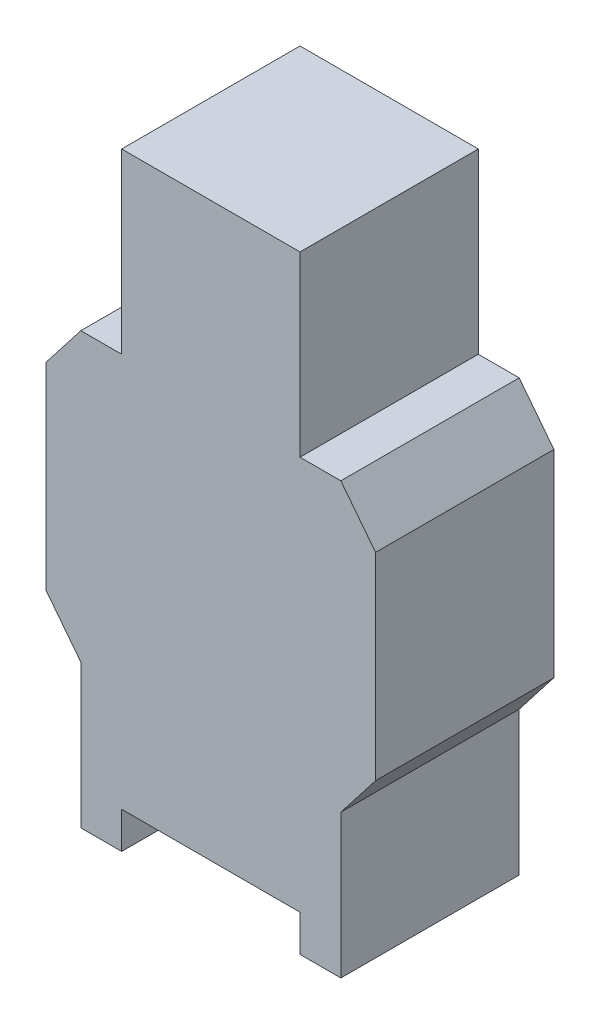
ISO-10303-21;
HEADER;
FILE_DESCRIPTION(('STEP AP214'),'2;1');
FILE_NAME('part.step','',(''),(''),'','','');
FILE_SCHEMA(('AUTOMOTIVE_DESIGN { 1 0 10303 214 1 1 1 1 }'));
ENDSEC;
DATA;
#1=APPLICATION_CONTEXT('core data for automotive mechanical design processes');
#2=APPLICATION_PROTOCOL_DEFINITION('international standard','automotive_design',2000,#1);
#3=PRODUCT_CONTEXT('',#1,'mechanical');
#4=PRODUCT('Part','Part','',(#3));
#5=PRODUCT_RELATED_PRODUCT_CATEGORY('part','',(#4));
#6=PRODUCT_DEFINITION_FORMATION('','',#4);
#7=PRODUCT_DEFINITION_CONTEXT('part definition',#1,'design');
#8=PRODUCT_DEFINITION('design','',#6,#7);
#9=PRODUCT_DEFINITION_SHAPE('','',#8);
#10=(LENGTH_UNIT() NAMED_UNIT(*) SI_UNIT(.MILLI.,.METRE.));
#11=(NAMED_UNIT(*) PLANE_ANGLE_UNIT() SI_UNIT($,.RADIAN.));
#12=(NAMED_UNIT(*) SI_UNIT($,.STERADIAN.) SOLID_ANGLE_UNIT());
#13=UNCERTAINTY_MEASURE_WITH_UNIT(LENGTH_MEASURE(1.E-05),#10,'distance_accuracy_value','');
#14=(GEOMETRIC_REPRESENTATION_CONTEXT(3) GLOBAL_UNCERTAINTY_ASSIGNED_CONTEXT((#13)) GLOBAL_UNIT_ASSIGNED_CONTEXT((#10,
#11,#12)) REPRESENTATION_CONTEXT('',''));
#15=CARTESIAN_POINT('',(0.,0.,0.));
#16=DIRECTION('',(0.,0.,1.));
#17=DIRECTION('',(1.,0.,0.));
#18=AXIS2_PLACEMENT_3D('',#15,#16,#17);
#19=CARTESIAN_POINT('',(0.,3.69896652974974,1.524));
#20=DIRECTION('',(0.,1.,0.));
#21=DIRECTION('',(0.,0.,1.));
#22=AXIS2_PLACEMENT_3D('',#19,#20,#21);
#23=PLANE('',#22);
#24=DIRECTION('',(1.,0.,0.));
#25=VECTOR('',#24,1.);
#26=CARTESIAN_POINT('',(0.,3.69896652974974,0.));
#27=LINE('',#26,#25);
#28=CARTESIAN_POINT('',(-0.349085688316663,3.69896652974974,0.));
#29=VERTEX_POINT('',#28);
#30=CARTESIAN_POINT('',(0.,3.69896652974974,0.));
#31=VERTEX_POINT('',#30);
#32=EDGE_CURVE('E188',#29,#31,#27,.T.);
#33=ORIENTED_EDGE('',*,*,#32,.F.);
#34=DIRECTION('',(0.,0.,-1.));
#35=VECTOR('',#34,1.);
#36=CARTESIAN_POINT('',(-0.349085688316663,3.69896652974974,1.524));
#37=LINE('',#36,#35);
#38=CARTESIAN_POINT('',(-0.349085688316663,3.69896652974974,1.524));
#39=VERTEX_POINT('',#38);
#40=EDGE_CURVE('E11',#39,#29,#37,.T.);
#41=ORIENTED_EDGE('',*,*,#40,.F.);
#42=DIRECTION('',(1.,0.,0.));
#43=VECTOR('',#42,1.);
#44=CARTESIAN_POINT('',(0.,3.69896652974974,1.524));
#45=LINE('',#44,#43);
#46=CARTESIAN_POINT('',(0.,3.69896652974974,1.524));
#47=VERTEX_POINT('',#46);
#48=EDGE_CURVE('E236',#39,#47,#45,.T.);
#49=ORIENTED_EDGE('',*,*,#48,.T.);
#50=DIRECTION('',(0.,0.,-1.));
#51=VECTOR('',#50,1.);
#52=CARTESIAN_POINT('',(0.,3.69896652974974,1.524));
#53=LINE('',#52,#51);
#54=EDGE_CURVE('E114',#47,#31,#53,.T.);
#55=ORIENTED_EDGE('',*,*,#54,.T.);
#56=EDGE_LOOP('',(#33,#41,#49,#55));
#57=FACE_BOUND('',#56,.T.);
#58=ADVANCED_FACE('F34',(#57),#23,.T.);
#59=CARTESIAN_POINT('',(-2.0100397831053,1.56311891895276,1.524));
#60=DIRECTION('',(0.789398911897141,-0.613880572990879,0.));
#61=DIRECTION('',(0.613880572990879,0.789398911897141,0.));
#62=AXIS2_PLACEMENT_3D('',#59,#60,#61);
#63=PLANE('',#62);
#64=DIRECTION('',(-0.613880572990879,-0.789398911897141,0.));
#65=VECTOR('',#64,1.);
#66=CARTESIAN_POINT('',(-2.0100397831053,1.56311891895276,0.));
#67=LINE('',#66,#65);
#68=CARTESIAN_POINT('',(-0.645840011106303,3.31736536851801,0.));
#69=VERTEX_POINT('',#68);
#70=EDGE_CURVE('E191',#29,#69,#67,.T.);
#71=ORIENTED_EDGE('',*,*,#70,.T.);
#72=DIRECTION('',(0.,0.,-1.));
#73=VECTOR('',#72,1.);
#74=CARTESIAN_POINT('',(-0.645840011106303,3.31736536851801,1.524));
#75=LINE('',#74,#73);
#76=CARTESIAN_POINT('',(-0.645840011106303,3.31736536851801,1.524));
#77=VERTEX_POINT('',#76);
#78=EDGE_CURVE('E42',#77,#69,#75,.T.);
#79=ORIENTED_EDGE('',*,*,#78,.F.);
#80=DIRECTION('',(-0.613880572990879,-0.789398911897141,0.));
#81=VECTOR('',#80,1.);
#82=CARTESIAN_POINT('',(-2.0100397831053,1.56311891895276,1.524));
#83=LINE('',#82,#81);
#84=EDGE_CURVE('E286',#39,#77,#83,.T.);
#85=ORIENTED_EDGE('',*,*,#84,.F.);
#86=ORIENTED_EDGE('',*,*,#40,.T.);
#87=EDGE_LOOP('',(#71,#79,#85,#86));
#88=FACE_BOUND('',#87,.T.);
#89=ADVANCED_FACE('F274',(#88),#63,.F.);
#90=CARTESIAN_POINT('',(-0.645840011106303,0.,1.524));
#91=DIRECTION('',(-1.,0.,0.));
#92=DIRECTION('',(0.,0.,1.));
#93=AXIS2_PLACEMENT_3D('',#90,#91,#92);
#94=PLANE('',#93);
#95=DIRECTION('',(0.,1.,0.));
#96=VECTOR('',#95,1.);
#97=CARTESIAN_POINT('',(-0.645840011106303,0.,0.));
#98=LINE('',#97,#96);
#99=CARTESIAN_POINT('',(-0.645840011106303,1.62779790237203,0.));
#100=VERTEX_POINT('',#99);
#101=EDGE_CURVE('E194',#100,#69,#98,.T.);
#102=ORIENTED_EDGE('',*,*,#101,.F.);
#103=DIRECTION('',(0.,0.,-1.));
#104=VECTOR('',#103,1.);
#105=CARTESIAN_POINT('',(-0.645840011106303,1.62779790237203,1.524));
#106=LINE('',#105,#104);
#107=CARTESIAN_POINT('',(-0.645840011106303,1.62779790237203,1.524));
#108=VERTEX_POINT('',#107);
#109=EDGE_CURVE('E264',#108,#100,#106,.T.);
#110=ORIENTED_EDGE('',*,*,#109,.F.);
#111=DIRECTION('',(0.,1.,0.));
#112=VECTOR('',#111,1.);
#113=CARTESIAN_POINT('',(-0.645840011106303,0.,1.524));
#114=LINE('',#113,#112);
#115=EDGE_CURVE('E271',#108,#77,#114,.T.);
#116=ORIENTED_EDGE('',*,*,#115,.T.);
#117=ORIENTED_EDGE('',*,*,#78,.T.);
#118=EDGE_LOOP('',(#102,#110,#116,#117));
#119=FACE_BOUND('',#118,.T.);
#120=ADVANCED_FACE('F269',(#119),#94,.T.);
#121=CARTESIAN_POINT('',(0.386369803091609,0.300462684371114,1.524));
#122=DIRECTION('',(-0.789398911897139,-0.613880572990882,0.));
#123=DIRECTION('',(0.613880572990882,-0.789398911897139,0.));
#124=AXIS2_PLACEMENT_3D('',#121,#122,#123);
#125=PLANE('',#124);
#126=DIRECTION('',(-0.613880572990882,0.789398911897139,0.));
#127=VECTOR('',#126,1.);
#128=CARTESIAN_POINT('',(0.386369803091609,0.300462684371114,0.));
#129=LINE('',#128,#127);
#130=CARTESIAN_POINT('',(-0.349085688316664,1.24619674114031,0.));
#131=VERTEX_POINT('',#130);
#132=EDGE_CURVE('E197',#131,#100,#129,.T.);
#133=ORIENTED_EDGE('',*,*,#132,.F.);
#134=DIRECTION('',(0.,0.,-1.));
#135=VECTOR('',#134,1.);
#136=CARTESIAN_POINT('',(-0.349085688316664,1.24619674114031,1.524));
#137=LINE('',#136,#135);
#138=CARTESIAN_POINT('',(-0.349085688316664,1.24619674114031,1.524));
#139=VERTEX_POINT('',#138);
#140=EDGE_CURVE('E262',#139,#131,#137,.T.);
#141=ORIENTED_EDGE('',*,*,#140,.F.);
#142=DIRECTION('',(-0.613880572990882,0.789398911897139,0.));
#143=VECTOR('',#142,1.);
#144=CARTESIAN_POINT('',(0.386369803091609,0.300462684371114,1.524));
#145=LINE('',#144,#143);
#146=EDGE_CURVE('E285',#139,#108,#145,.T.);
#147=ORIENTED_EDGE('',*,*,#146,.T.);
#148=ORIENTED_EDGE('',*,*,#109,.T.);
#149=EDGE_LOOP('',(#133,#141,#147,#148));
#150=FACE_BOUND('',#149,.T.);
#151=ADVANCED_FACE('F281',(#150),#125,.T.);
#152=CARTESIAN_POINT('',(-0.349085688316664,0.,1.524));
#153=DIRECTION('',(1.,0.,0.));
#154=DIRECTION('',(0.,1.,0.));
#155=AXIS2_PLACEMENT_3D('',#152,#153,#154);
#156=PLANE('',#155);
#157=DIRECTION('',(0.,-1.,0.));
#158=VECTOR('',#157,1.);
#159=CARTESIAN_POINT('',(-0.349085688316664,0.,0.));
#160=LINE('',#159,#158);
#161=CARTESIAN_POINT('',(-0.349085688316664,0.0190384571396862,0.));
#162=VERTEX_POINT('',#161);
#163=EDGE_CURVE('E200',#131,#162,#160,.T.);
#164=ORIENTED_EDGE('',*,*,#163,.T.);
#165=DIRECTION('',(0.,0.,-1.));
#166=VECTOR('',#165,1.);
#167=CARTESIAN_POINT('',(-0.349085688316664,0.0190384571396862,1.524));
#168=LINE('',#167,#166);
#169=CARTESIAN_POINT('',(-0.349085688316664,0.0190384571396862,1.524));
#170=VERTEX_POINT('',#169);
#171=EDGE_CURVE('E259',#170,#162,#168,.T.);
#172=ORIENTED_EDGE('',*,*,#171,.F.);
#173=DIRECTION('',(0.,-1.,0.));
#174=VECTOR('',#173,1.);
#175=CARTESIAN_POINT('',(-0.349085688316664,0.,1.524));
#176=LINE('',#175,#174);
#177=EDGE_CURVE('E288',#139,#170,#176,.T.);
#178=ORIENTED_EDGE('',*,*,#177,.F.);
#179=ORIENTED_EDGE('',*,*,#140,.T.);
#180=EDGE_LOOP('',(#164,#172,#178,#179));
#181=FACE_BOUND('',#180,.T.);
#182=ADVANCED_FACE('F333',(#181),#156,.F.);
#183=CARTESIAN_POINT('',(0.,0.0190384571396864,1.524));
#184=DIRECTION('',(0.,1.,0.));
#185=DIRECTION('',(-1.,0.,0.));
#186=AXIS2_PLACEMENT_3D('',#183,#184,#185);
#187=PLANE('',#186);
#188=DIRECTION('',(1.,0.,0.));
#189=VECTOR('',#188,1.);
#190=CARTESIAN_POINT('',(0.,0.0190384571396864,0.));
#191=LINE('',#190,#189);
#192=CARTESIAN_POINT('',(0.,0.0190384571396864,0.));
#193=VERTEX_POINT('',#192);
#194=EDGE_CURVE('E202',#162,#193,#191,.T.);
#195=ORIENTED_EDGE('',*,*,#194,.T.);
#196=DIRECTION('',(0.,0.,-1.));
#197=VECTOR('',#196,1.);
#198=CARTESIAN_POINT('',(0.,0.0190384571396864,1.524));
#199=LINE('',#198,#197);
#200=CARTESIAN_POINT('',(0.,0.0190384571396864,1.524));
#201=VERTEX_POINT('',#200);
#202=EDGE_CURVE('E257',#201,#193,#199,.T.);
#203=ORIENTED_EDGE('',*,*,#202,.F.);
#204=DIRECTION('',(1.,0.,0.));
#205=VECTOR('',#204,1.);
#206=CARTESIAN_POINT('',(0.,0.0190384571396864,1.524));
#207=LINE('',#206,#205);
#208=EDGE_CURVE('E294',#170,#201,#207,.T.);
#209=ORIENTED_EDGE('',*,*,#208,.F.);
#210=ORIENTED_EDGE('',*,*,#171,.T.);
#211=EDGE_LOOP('',(#195,#203,#209,#210));
#212=FACE_BOUND('',#211,.T.);
#213=ADVANCED_FACE('F336',(#212),#187,.F.);
#214=CARTESIAN_POINT('',(0.,0.,1.524));
#215=DIRECTION('',(1.,0.,0.));
#216=DIRECTION('',(0.,1.,0.));
#217=AXIS2_PLACEMENT_3D('',#214,#215,#216);
#218=PLANE('',#217);
#219=DIRECTION('',(0.,-1.,0.));
#220=VECTOR('',#219,1.);
#221=CARTESIAN_POINT('',(0.,0.,0.));
#222=LINE('',#221,#220);
#223=CARTESIAN_POINT('',(0.,0.33135760170726,0.));
#224=VERTEX_POINT('',#223);
#225=EDGE_CURVE('E205',#224,#193,#222,.T.);
#226=ORIENTED_EDGE('',*,*,#225,.F.);
#227=DIRECTION('',(0.,0.,-1.));
#228=VECTOR('',#227,1.);
#229=CARTESIAN_POINT('',(0.,0.33135760170726,1.524));
#230=LINE('',#229,#228);
#231=CARTESIAN_POINT('',(0.,0.33135760170726,1.524));
#232=VERTEX_POINT('',#231);
#233=EDGE_CURVE('E255',#232,#224,#230,.T.);
#234=ORIENTED_EDGE('',*,*,#233,.F.);
#235=DIRECTION('',(0.,-1.,0.));
#236=VECTOR('',#235,1.);
#237=CARTESIAN_POINT('',(0.,0.,1.524));
#238=LINE('',#237,#236);
#239=EDGE_CURVE('E296',#232,#201,#238,.T.);
#240=ORIENTED_EDGE('',*,*,#239,.T.);
#241=ORIENTED_EDGE('',*,*,#202,.T.);
#242=EDGE_LOOP('',(#226,#234,#240,#241));
#243=FACE_BOUND('',#242,.T.);
#244=ADVANCED_FACE('F340',(#243),#218,.T.);
#245=CARTESIAN_POINT('',(0.,0.33135760170726,1.524));
#246=DIRECTION('',(0.,-1.,0.));
#247=DIRECTION('',(0.,0.,-1.));
#248=AXIS2_PLACEMENT_3D('',#245,#246,#247);
#249=PLANE('',#248);
#250=DIRECTION('',(-1.,0.,0.));
#251=VECTOR('',#250,1.);
#252=CARTESIAN_POINT('',(0.,0.33135760170726,0.));
#253=LINE('',#252,#251);
#254=CARTESIAN_POINT('',(1.52400000000001,0.33135760170726,0.));
#255=VERTEX_POINT('',#254);
#256=EDGE_CURVE('E208',#255,#224,#253,.T.);
#257=ORIENTED_EDGE('',*,*,#256,.F.);
#258=DIRECTION('',(0.,0.,-1.));
#259=VECTOR('',#258,1.);
#260=CARTESIAN_POINT('',(1.52400000000001,0.33135760170726,1.524));
#261=LINE('',#260,#259);
#262=CARTESIAN_POINT('',(1.52400000000001,0.33135760170726,1.524));
#263=VERTEX_POINT('',#262);
#264=EDGE_CURVE('E253',#263,#255,#261,.T.);
#265=ORIENTED_EDGE('',*,*,#264,.F.);
#266=DIRECTION('',(-1.,0.,0.));
#267=VECTOR('',#266,1.);
#268=CARTESIAN_POINT('',(0.,0.33135760170726,1.524));
#269=LINE('',#268,#267);
#270=EDGE_CURVE('E299',#263,#232,#269,.T.);
#271=ORIENTED_EDGE('',*,*,#270,.T.);
#272=ORIENTED_EDGE('',*,*,#233,.T.);
#273=EDGE_LOOP('',(#257,#265,#271,#272));
#274=FACE_BOUND('',#273,.T.);
#275=ADVANCED_FACE('F344',(#274),#249,.T.);
#276=CARTESIAN_POINT('',(1.52400000000001,0.,1.524));
#277=DIRECTION('',(-1.,0.,0.));
#278=DIRECTION('',(0.,0.,1.));
#279=AXIS2_PLACEMENT_3D('',#276,#277,#278);
#280=PLANE('',#279);
#281=DIRECTION('',(0.,1.,0.));
#282=VECTOR('',#281,1.);
#283=CARTESIAN_POINT('',(1.52400000000001,0.,0.));
#284=LINE('',#283,#282);
#285=CARTESIAN_POINT('',(1.52400000000001,0.0190384571396862,0.));
#286=VERTEX_POINT('',#285);
#287=EDGE_CURVE('E211',#286,#255,#284,.T.);
#288=ORIENTED_EDGE('',*,*,#287,.F.);
#289=DIRECTION('',(0.,0.,-1.));
#290=VECTOR('',#289,1.);
#291=CARTESIAN_POINT('',(1.52400000000001,0.0190384571396862,1.524));
#292=LINE('',#291,#290);
#293=CARTESIAN_POINT('',(1.52400000000001,0.0190384571396862,1.524));
#294=VERTEX_POINT('',#293);
#295=EDGE_CURVE('E251',#294,#286,#292,.T.);
#296=ORIENTED_EDGE('',*,*,#295,.F.);
#297=DIRECTION('',(0.,1.,0.));
#298=VECTOR('',#297,1.);
#299=CARTESIAN_POINT('',(1.52400000000001,0.,1.524));
#300=LINE('',#299,#298);
#301=EDGE_CURVE('E302',#294,#263,#300,.T.);
#302=ORIENTED_EDGE('',*,*,#301,.T.);
#303=ORIENTED_EDGE('',*,*,#264,.T.);
#304=EDGE_LOOP('',(#288,#296,#302,#303));
#305=FACE_BOUND('',#304,.T.);
#306=ADVANCED_FACE('F348',(#305),#280,.T.);
#307=CARTESIAN_POINT('',(0.,0.0190384571396861,1.524));
#308=DIRECTION('',(0.,-1.,0.));
#309=DIRECTION('',(1.,0.,0.));
#310=AXIS2_PLACEMENT_3D('',#307,#308,#309);
#311=PLANE('',#310);
#312=DIRECTION('',(-1.,0.,0.));
#313=VECTOR('',#312,1.);
#314=CARTESIAN_POINT('',(0.,0.0190384571396861,0.));
#315=LINE('',#314,#313);
#316=CARTESIAN_POINT('',(1.87308568831668,0.0190384571396862,0.));
#317=VERTEX_POINT('',#316);
#318=EDGE_CURVE('E214',#317,#286,#315,.T.);
#319=ORIENTED_EDGE('',*,*,#318,.F.);
#320=DIRECTION('',(0.,0.,-1.));
#321=VECTOR('',#320,1.);
#322=CARTESIAN_POINT('',(1.87308568831668,0.0190384571396862,1.524));
#323=LINE('',#322,#321);
#324=CARTESIAN_POINT('',(1.87308568831668,0.0190384571396862,1.524));
#325=VERTEX_POINT('',#324);
#326=EDGE_CURVE('E249',#325,#317,#323,.T.);
#327=ORIENTED_EDGE('',*,*,#326,.F.);
#328=DIRECTION('',(-1.,0.,0.));
#329=VECTOR('',#328,1.);
#330=CARTESIAN_POINT('',(0.,0.0190384571396861,1.524));
#331=LINE('',#330,#329);
#332=EDGE_CURVE('E305',#325,#294,#331,.T.);
#333=ORIENTED_EDGE('',*,*,#332,.T.);
#334=ORIENTED_EDGE('',*,*,#295,.T.);
#335=EDGE_LOOP('',(#319,#327,#333,#334));
#336=FACE_BOUND('',#335,.T.);
#337=ADVANCED_FACE('F352',(#336),#311,.T.);
#338=CARTESIAN_POINT('',(1.87308568831668,0.,1.524));
#339=DIRECTION('',(1.,0.,0.));
#340=DIRECTION('',(0.,1.,0.));
#341=AXIS2_PLACEMENT_3D('',#338,#339,#340);
#342=PLANE('',#341);
#343=DIRECTION('',(0.,-1.,0.));
#344=VECTOR('',#343,1.);
#345=CARTESIAN_POINT('',(1.87308568831668,0.,0.));
#346=LINE('',#345,#344);
#347=CARTESIAN_POINT('',(1.87308568831668,1.24619674114031,0.));
#348=VERTEX_POINT('',#347);
#349=EDGE_CURVE('E217',#348,#317,#346,.T.);
#350=ORIENTED_EDGE('',*,*,#349,.F.);
#351=DIRECTION('',(0.,0.,-1.));
#352=VECTOR('',#351,1.);
#353=CARTESIAN_POINT('',(1.87308568831668,1.24619674114031,1.524));
#354=LINE('',#353,#352);
#355=CARTESIAN_POINT('',(1.87308568831668,1.24619674114031,1.524));
#356=VERTEX_POINT('',#355);
#357=EDGE_CURVE('E247',#356,#348,#354,.T.);
#358=ORIENTED_EDGE('',*,*,#357,.F.);
#359=DIRECTION('',(0.,-1.,0.));
#360=VECTOR('',#359,1.);
#361=CARTESIAN_POINT('',(1.87308568831668,0.,1.524));
#362=LINE('',#361,#360);
#363=EDGE_CURVE('E308',#356,#325,#362,.T.);
#364=ORIENTED_EDGE('',*,*,#363,.T.);
#365=ORIENTED_EDGE('',*,*,#326,.T.);
#366=EDGE_LOOP('',(#350,#358,#364,#365));
#367=FACE_BOUND('',#366,.T.);
#368=ADVANCED_FACE('F356',(#367),#342,.T.);
#369=CARTESIAN_POINT('',(0.563311775475488,-0.438062619912076,1.524));
#370=DIRECTION('',(-0.78939891189714,0.61388057299088,0.));
#371=DIRECTION('',(-0.61388057299088,-0.78939891189714,0.));
#372=AXIS2_PLACEMENT_3D('',#369,#370,#371);
#373=PLANE('',#372);
#374=DIRECTION('',(0.61388057299088,0.78939891189714,0.));
#375=VECTOR('',#374,1.);
#376=CARTESIAN_POINT('',(0.563311775475488,-0.438062619912076,0.));
#377=LINE('',#376,#375);
#378=CARTESIAN_POINT('',(2.16984001110632,1.62779790237203,0.));
#379=VERTEX_POINT('',#378);
#380=EDGE_CURVE('E220',#348,#379,#377,.T.);
#381=ORIENTED_EDGE('',*,*,#380,.T.);
#382=DIRECTION('',(0.,0.,-1.));
#383=VECTOR('',#382,1.);
#384=CARTESIAN_POINT('',(2.16984001110632,1.62779790237203,1.524));
#385=LINE('',#384,#383);
#386=CARTESIAN_POINT('',(2.16984001110632,1.62779790237203,1.524));
#387=VERTEX_POINT('',#386);
#388=EDGE_CURVE('E244',#387,#379,#385,.T.);
#389=ORIENTED_EDGE('',*,*,#388,.F.);
#390=DIRECTION('',(0.61388057299088,0.78939891189714,0.));
#391=VECTOR('',#390,1.);
#392=CARTESIAN_POINT('',(0.563311775475488,-0.438062619912076,1.524));
#393=LINE('',#392,#391);
#394=EDGE_CURVE('E311',#356,#387,#393,.T.);
#395=ORIENTED_EDGE('',*,*,#394,.F.);
#396=ORIENTED_EDGE('',*,*,#357,.T.);
#397=EDGE_LOOP('',(#381,#389,#395,#396));
#398=FACE_BOUND('',#397,.T.);
#399=ADVANCED_FACE('F360',(#398),#373,.F.);
#400=CARTESIAN_POINT('',(2.16984001110632,0.,1.524));
#401=DIRECTION('',(-1.,0.,0.));
#402=DIRECTION('',(0.,0.,1.));
#403=AXIS2_PLACEMENT_3D('',#400,#401,#402);
#404=PLANE('',#403);
#405=DIRECTION('',(0.,1.,0.));
#406=VECTOR('',#405,1.);
#407=CARTESIAN_POINT('',(2.16984001110632,0.,0.));
#408=LINE('',#407,#406);
#409=CARTESIAN_POINT('',(2.16984001110632,3.31736536851802,0.));
#410=VERTEX_POINT('',#409);
#411=EDGE_CURVE('E222',#379,#410,#408,.T.);
#412=ORIENTED_EDGE('',*,*,#411,.T.);
#413=DIRECTION('',(0.,0.,-1.));
#414=VECTOR('',#413,1.);
#415=CARTESIAN_POINT('',(2.16984001110632,3.31736536851802,1.524));
#416=LINE('',#415,#414);
#417=CARTESIAN_POINT('',(2.16984001110632,3.31736536851802,1.524));
#418=VERTEX_POINT('',#417);
#419=EDGE_CURVE('E242',#418,#410,#416,.T.);
#420=ORIENTED_EDGE('',*,*,#419,.F.);
#421=DIRECTION('',(0.,1.,0.));
#422=VECTOR('',#421,1.);
#423=CARTESIAN_POINT('',(2.16984001110632,0.,1.524));
#424=LINE('',#423,#422);
#425=EDGE_CURVE('E313',#387,#418,#424,.T.);
#426=ORIENTED_EDGE('',*,*,#425,.F.);
#427=ORIENTED_EDGE('',*,*,#388,.T.);
#428=EDGE_LOOP('',(#412,#420,#426,#427));
#429=FACE_BOUND('',#428,.T.);
#430=ADVANCED_FACE('F364',(#429),#404,.F.);
#431=CARTESIAN_POINT('',(2.9597213616724,2.30164422323595,1.524));
#432=DIRECTION('',(0.78939891189714,0.61388057299088,0.));
#433=DIRECTION('',(-0.61388057299088,0.78939891189714,0.));
#434=AXIS2_PLACEMENT_3D('',#431,#432,#433);
#435=PLANE('',#434);
#436=DIRECTION('',(0.61388057299088,-0.78939891189714,0.));
#437=VECTOR('',#436,1.);
#438=CARTESIAN_POINT('',(2.9597213616724,2.30164422323595,0.));
#439=LINE('',#438,#437);
#440=CARTESIAN_POINT('',(1.87308568831668,3.69896652974974,0.));
#441=VERTEX_POINT('',#440);
#442=EDGE_CURVE('E225',#441,#410,#439,.T.);
#443=ORIENTED_EDGE('',*,*,#442,.F.);
#444=DIRECTION('',(0.,0.,-1.));
#445=VECTOR('',#444,1.);
#446=CARTESIAN_POINT('',(1.87308568831668,3.69896652974974,1.524));
#447=LINE('',#446,#445);
#448=CARTESIAN_POINT('',(1.87308568831668,3.69896652974974,1.524));
#449=VERTEX_POINT('',#448);
#450=EDGE_CURVE('E240',#449,#441,#447,.T.);
#451=ORIENTED_EDGE('',*,*,#450,.F.);
#452=DIRECTION('',(0.61388057299088,-0.78939891189714,0.));
#453=VECTOR('',#452,1.);
#454=CARTESIAN_POINT('',(2.9597213616724,2.30164422323595,1.524));
#455=LINE('',#454,#453);
#456=EDGE_CURVE('E315',#449,#418,#455,.T.);
#457=ORIENTED_EDGE('',*,*,#456,.T.);
#458=ORIENTED_EDGE('',*,*,#419,.T.);
#459=EDGE_LOOP('',(#443,#451,#457,#458));
#460=FACE_BOUND('',#459,.T.);
#461=ADVANCED_FACE('F368',(#460),#435,.T.);
#462=CARTESIAN_POINT('',(0.,3.69896652974974,1.524));
#463=DIRECTION('',(0.,1.,0.));
#464=DIRECTION('',(0.,0.,1.));
#465=AXIS2_PLACEMENT_3D('',#462,#463,#464);
#466=PLANE('',#465);
#467=DIRECTION('',(1.,0.,0.));
#468=VECTOR('',#467,1.);
#469=CARTESIAN_POINT('',(0.,3.69896652974974,0.));
#470=LINE('',#469,#468);
#471=CARTESIAN_POINT('',(1.52400000000001,3.69896652974974,0.));
#472=VERTEX_POINT('',#471);
#473=EDGE_CURVE('E228',#472,#441,#470,.T.);
#474=ORIENTED_EDGE('',*,*,#473,.F.);
#475=DIRECTION('',(0.,0.,-1.));
#476=VECTOR('',#475,1.);
#477=CARTESIAN_POINT('',(1.52400000000001,3.69896652974974,1.524));
#478=LINE('',#477,#476);
#479=CARTESIAN_POINT('',(1.52400000000001,3.69896652974974,1.524));
#480=VERTEX_POINT('',#479);
#481=EDGE_CURVE('E174',#480,#472,#478,.T.);
#482=ORIENTED_EDGE('',*,*,#481,.F.);
#483=DIRECTION('',(1.,0.,0.));
#484=VECTOR('',#483,1.);
#485=CARTESIAN_POINT('',(0.,3.69896652974974,1.524));
#486=LINE('',#485,#484);
#487=EDGE_CURVE('E181',#480,#449,#486,.T.);
#488=ORIENTED_EDGE('',*,*,#487,.T.);
#489=ORIENTED_EDGE('',*,*,#450,.T.);
#490=EDGE_LOOP('',(#474,#482,#488,#489));
#491=FACE_BOUND('',#490,.T.);
#492=ADVANCED_FACE('F319',(#491),#466,.T.);
#493=CARTESIAN_POINT('',(1.52400000000001,0.,1.524));
#494=DIRECTION('',(1.,0.,0.));
#495=DIRECTION('',(0.,0.,-1.));
#496=AXIS2_PLACEMENT_3D('',#493,#494,#495);
#497=PLANE('',#496);
#498=DIRECTION('',(0.,-1.,0.));
#499=VECTOR('',#498,1.);
#500=CARTESIAN_POINT('',(1.52400000000001,0.,0.));
#501=LINE('',#500,#499);
#502=CARTESIAN_POINT('',(1.52400000000001,5.21845167431935,0.));
#503=VERTEX_POINT('',#502);
#504=EDGE_CURVE('E169',#503,#472,#501,.T.);
#505=ORIENTED_EDGE('',*,*,#504,.F.);
#506=DIRECTION('',(0.,0.,-1.));
#507=VECTOR('',#506,1.);
#508=CARTESIAN_POINT('',(1.52400000000001,5.21845167431935,1.524));
#509=LINE('',#508,#507);
#510=CARTESIAN_POINT('',(1.52400000000001,5.21845167431935,1.524));
#511=VERTEX_POINT('',#510);
#512=EDGE_CURVE('E164',#511,#503,#509,.T.);
#513=ORIENTED_EDGE('',*,*,#512,.F.);
#514=DIRECTION('',(0.,-1.,0.));
#515=VECTOR('',#514,1.);
#516=CARTESIAN_POINT('',(1.52400000000001,0.,1.524));
#517=LINE('',#516,#515);
#518=EDGE_CURVE('E167',#511,#480,#517,.T.);
#519=ORIENTED_EDGE('',*,*,#518,.T.);
#520=ORIENTED_EDGE('',*,*,#481,.T.);
#521=EDGE_LOOP('',(#505,#513,#519,#520));
#522=FACE_BOUND('',#521,.T.);
#523=ADVANCED_FACE('F166',(#522),#497,.T.);
#524=CARTESIAN_POINT('',(0.,5.21845167431935,1.524));
#525=DIRECTION('',(0.,1.,0.));
#526=DIRECTION('',(0.,0.,1.));
#527=AXIS2_PLACEMENT_3D('',#524,#525,#526);
#528=PLANE('',#527);
#529=DIRECTION('',(1.,0.,0.));
#530=VECTOR('',#529,1.);
#531=CARTESIAN_POINT('',(0.,5.21845167431935,0.));
#532=LINE('',#531,#530);
#533=CARTESIAN_POINT('',(0.,5.21845167431935,0.));
#534=VERTEX_POINT('',#533);
#535=EDGE_CURVE('E232',#534,#503,#532,.T.);
#536=ORIENTED_EDGE('',*,*,#535,.F.);
#537=DIRECTION('',(0.,0.,-1.));
#538=VECTOR('',#537,1.);
#539=CARTESIAN_POINT('',(0.,5.21845167431935,1.524));
#540=LINE('',#539,#538);
#541=CARTESIAN_POINT('',(0.,5.21845167431935,1.524));
#542=VERTEX_POINT('',#541);
#543=EDGE_CURVE('E107',#542,#534,#540,.T.);
#544=ORIENTED_EDGE('',*,*,#543,.F.);
#545=DIRECTION('',(1.,0.,0.));
#546=VECTOR('',#545,1.);
#547=CARTESIAN_POINT('',(0.,5.21845167431935,1.524));
#548=LINE('',#547,#546);
#549=EDGE_CURVE('E178',#542,#511,#548,.T.);
#550=ORIENTED_EDGE('',*,*,#549,.T.);
#551=ORIENTED_EDGE('',*,*,#512,.T.);
#552=EDGE_LOOP('',(#536,#544,#550,#551));
#553=FACE_BOUND('',#552,.T.);
#554=ADVANCED_FACE('F183',(#553),#528,.T.);
#555=CARTESIAN_POINT('',(0.,0.,1.524));
#556=DIRECTION('',(1.,0.,0.));
#557=DIRECTION('',(0.,0.,-1.));
#558=AXIS2_PLACEMENT_3D('',#555,#556,#557);
#559=PLANE('',#558);
#560=DIRECTION('',(0.,-1.,0.));
#561=VECTOR('',#560,1.);
#562=CARTESIAN_POINT('',(0.,0.,0.));
#563=LINE('',#562,#561);
#564=EDGE_CURVE('E234',#534,#31,#563,.T.);
#565=ORIENTED_EDGE('',*,*,#564,.T.);
#566=ORIENTED_EDGE('',*,*,#54,.F.);
#567=DIRECTION('',(0.,-1.,0.));
#568=VECTOR('',#567,1.);
#569=CARTESIAN_POINT('',(0.,0.,1.524));
#570=LINE('',#569,#568);
#571=EDGE_CURVE('E50',#542,#47,#570,.T.);
#572=ORIENTED_EDGE('',*,*,#571,.F.);
#573=ORIENTED_EDGE('',*,*,#543,.T.);
#574=EDGE_LOOP('',(#565,#566,#572,#573));
#575=FACE_BOUND('',#574,.T.);
#576=ADVANCED_FACE('F321',(#575),#559,.F.);
#577=CARTESIAN_POINT('',(0.,0.,1.524));
#578=DIRECTION('',(0.,0.,1.));
#579=DIRECTION('',(1.,0.,0.));
#580=AXIS2_PLACEMENT_3D('',#577,#578,#579);
#581=PLANE('',#580);
#582=ORIENTED_EDGE('',*,*,#48,.F.);
#583=ORIENTED_EDGE('',*,*,#84,.T.);
#584=ORIENTED_EDGE('',*,*,#115,.F.);
#585=ORIENTED_EDGE('',*,*,#146,.F.);
#586=ORIENTED_EDGE('',*,*,#177,.T.);
#587=ORIENTED_EDGE('',*,*,#208,.T.);
#588=ORIENTED_EDGE('',*,*,#239,.F.);
#589=ORIENTED_EDGE('',*,*,#270,.F.);
#590=ORIENTED_EDGE('',*,*,#301,.F.);
#591=ORIENTED_EDGE('',*,*,#332,.F.);
#592=ORIENTED_EDGE('',*,*,#363,.F.);
#593=ORIENTED_EDGE('',*,*,#394,.T.);
#594=ORIENTED_EDGE('',*,*,#425,.T.);
#595=ORIENTED_EDGE('',*,*,#456,.F.);
#596=ORIENTED_EDGE('',*,*,#487,.F.);
#597=ORIENTED_EDGE('',*,*,#518,.F.);
#598=ORIENTED_EDGE('',*,*,#549,.F.);
#599=ORIENTED_EDGE('',*,*,#571,.T.);
#600=EDGE_LOOP('',(#582,#583,#584,#585,#586,#587,#588,#589,#590,#591,#592,#593,#594,#595,#596,
#597,#598,#599));
#601=FACE_BOUND('',#600,.T.);
#602=ADVANCED_FACE('F177',(#601),#581,.T.);
#603=CARTESIAN_POINT('',(0.,0.,0.));
#604=DIRECTION('',(0.,0.,1.));
#605=DIRECTION('',(1.,0.,0.));
#606=AXIS2_PLACEMENT_3D('',#603,#604,#605);
#607=PLANE('',#606);
#608=ORIENTED_EDGE('',*,*,#32,.T.);
#609=ORIENTED_EDGE('',*,*,#564,.F.);
#610=ORIENTED_EDGE('',*,*,#535,.T.);
#611=ORIENTED_EDGE('',*,*,#504,.T.);
#612=ORIENTED_EDGE('',*,*,#473,.T.);
#613=ORIENTED_EDGE('',*,*,#442,.T.);
#614=ORIENTED_EDGE('',*,*,#411,.F.);
#615=ORIENTED_EDGE('',*,*,#380,.F.);
#616=ORIENTED_EDGE('',*,*,#349,.T.);
#617=ORIENTED_EDGE('',*,*,#318,.T.);
#618=ORIENTED_EDGE('',*,*,#287,.T.);
#619=ORIENTED_EDGE('',*,*,#256,.T.);
#620=ORIENTED_EDGE('',*,*,#225,.T.);
#621=ORIENTED_EDGE('',*,*,#194,.F.);
#622=ORIENTED_EDGE('',*,*,#163,.F.);
#623=ORIENTED_EDGE('',*,*,#132,.T.);
#624=ORIENTED_EDGE('',*,*,#101,.T.);
#625=ORIENTED_EDGE('',*,*,#70,.F.);
#626=EDGE_LOOP('',(#608,#609,#610,#611,#612,#613,#614,#615,#616,#617,#618,#619,#620,#621,#622,
#623,#624,#625));
#627=FACE_BOUND('',#626,.T.);
#628=ADVANCED_FACE('F276',(#627),#607,.F.);
#629=CLOSED_SHELL('',(#58,#89,#120,#151,#182,#213,#244,#275,#306,#337,#368,#399,#430,#461,#492,
#523,#554,#576,#602,#628));
#630=MANIFOLD_SOLID_BREP('B2',#629);
#631=ADVANCED_BREP_SHAPE_REPRESENTATION('',(#18,#630),#14);
#632=SHAPE_DEFINITION_REPRESENTATION(#9,#631);
ENDSEC;
END-ISO-10303-21;
